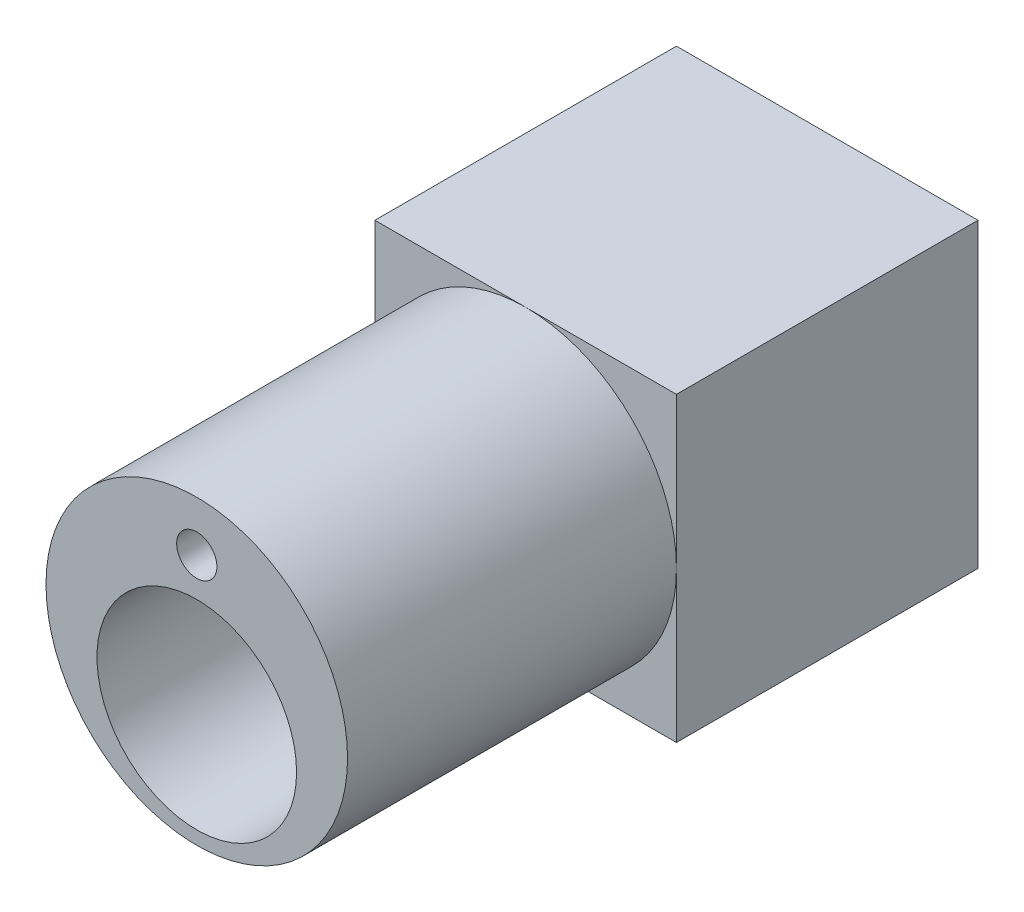
ISO-10303-21;
HEADER;
FILE_DESCRIPTION(('STEP AP214'),'2;1');
FILE_NAME('part.step','',(''),(''),'','','');
FILE_SCHEMA(('AUTOMOTIVE_DESIGN { 1 0 10303 214 1 1 1 1 }'));
ENDSEC;
DATA;
#1=APPLICATION_CONTEXT('core data for automotive mechanical design processes');
#2=APPLICATION_PROTOCOL_DEFINITION('international standard','automotive_design',2000,#1);
#3=PRODUCT_CONTEXT('',#1,'mechanical');
#4=PRODUCT('Part','Part','',(#3));
#5=PRODUCT_RELATED_PRODUCT_CATEGORY('part','',(#4));
#6=PRODUCT_DEFINITION_FORMATION('','',#4);
#7=PRODUCT_DEFINITION_CONTEXT('part definition',#1,'design');
#8=PRODUCT_DEFINITION('design','',#6,#7);
#9=PRODUCT_DEFINITION_SHAPE('','',#8);
#10=(LENGTH_UNIT() NAMED_UNIT(*) SI_UNIT(.MILLI.,.METRE.));
#11=(NAMED_UNIT(*) PLANE_ANGLE_UNIT() SI_UNIT($,.RADIAN.));
#12=(NAMED_UNIT(*) SI_UNIT($,.STERADIAN.) SOLID_ANGLE_UNIT());
#13=UNCERTAINTY_MEASURE_WITH_UNIT(LENGTH_MEASURE(1.E-05),#10,'distance_accuracy_value','');
#14=(GEOMETRIC_REPRESENTATION_CONTEXT(3) GLOBAL_UNCERTAINTY_ASSIGNED_CONTEXT((#13)) GLOBAL_UNIT_ASSIGNED_CONTEXT((#10,
#11,#12)) REPRESENTATION_CONTEXT('',''));
#15=CARTESIAN_POINT('',(0.,0.,0.));
#16=DIRECTION('',(0.,0.,1.));
#17=DIRECTION('',(1.,0.,0.));
#18=AXIS2_PLACEMENT_3D('',#15,#16,#17);
#19=CARTESIAN_POINT('',(0.,0.,61.3));
#20=DIRECTION('',(0.,0.,-1.));
#21=DIRECTION('',(-1.,0.,0.));
#22=AXIS2_PLACEMENT_3D('',#19,#20,#21);
#23=CYLINDRICAL_SURFACE('',#22,28.1);
#24=CARTESIAN_POINT('',(0.,0.,0.));
#25=DIRECTION('',(0.,0.,1.));
#26=DIRECTION('',(1.,0.,0.));
#27=AXIS2_PLACEMENT_3D('',#24,#25,#26);
#28=CIRCLE('',#27,28.1);
#29=CARTESIAN_POINT('',(-28.1,0.,0.));
#30=VERTEX_POINT('',#29);
#31=CARTESIAN_POINT('',(0.,-28.1,0.));
#32=VERTEX_POINT('',#31);
#33=EDGE_CURVE('E353',#30,#32,#28,.T.);
#34=ORIENTED_EDGE('',*,*,#33,.T.);
#35=CARTESIAN_POINT('',(28.1,0.,0.));
#36=VERTEX_POINT('',#35);
#37=EDGE_CURVE('E269',#32,#36,#28,.T.);
#38=ORIENTED_EDGE('',*,*,#37,.T.);
#39=CARTESIAN_POINT('',(0.,28.1,0.));
#40=VERTEX_POINT('',#39);
#41=EDGE_CURVE('E276',#36,#40,#28,.T.);
#42=ORIENTED_EDGE('',*,*,#41,.T.);
#43=EDGE_CURVE('E279',#40,#30,#28,.T.);
#44=ORIENTED_EDGE('',*,*,#43,.T.);
#45=EDGE_LOOP('',(#34,#38,#42,#44));
#46=FACE_BOUND('',#45,.T.);
#47=CARTESIAN_POINT('',(0.,0.,61.3));
#48=DIRECTION('',(0.,0.,1.));
#49=DIRECTION('',(1.,0.,0.));
#50=AXIS2_PLACEMENT_3D('',#47,#48,#49);
#51=CIRCLE('',#50,28.1);
#52=CARTESIAN_POINT('',(28.1,0.,61.3));
#53=VERTEX_POINT('',#52);
#54=EDGE_CURVE('E47',#53,#53,#51,.T.);
#55=ORIENTED_EDGE('',*,*,#54,.F.);
#56=EDGE_LOOP('',(#55));
#57=FACE_BOUND('',#56,.T.);
#58=ADVANCED_FACE('F39',(#46,#57),#23,.T.);
#59=CARTESIAN_POINT('',(0.,0.,61.3));
#60=DIRECTION('',(0.,0.,1.));
#61=DIRECTION('',(1.,0.,0.));
#62=AXIS2_PLACEMENT_3D('',#59,#60,#61);
#63=PLANE('',#62);
#64=CARTESIAN_POINT('',(0.,18.75,61.3));
#65=DIRECTION('',(0.,0.,1.));
#66=DIRECTION('',(1.,0.,0.));
#67=AXIS2_PLACEMENT_3D('',#64,#65,#66);
#68=CIRCLE('',#67,3.75);
#69=CARTESIAN_POINT('',(3.75,18.75,61.3));
#70=VERTEX_POINT('',#69);
#71=EDGE_CURVE('E284',#70,#70,#68,.T.);
#72=ORIENTED_EDGE('',*,*,#71,.F.);
#73=EDGE_LOOP('',(#72));
#74=FACE_BOUND('',#73,.T.);
#75=CARTESIAN_POINT('',(0.,-7.,61.3));
#76=DIRECTION('',(0.,0.,1.));
#77=DIRECTION('',(1.,0.,0.));
#78=AXIS2_PLACEMENT_3D('',#75,#76,#77);
#79=CIRCLE('',#78,18.6);
#80=CARTESIAN_POINT('',(18.6,-7.,61.3));
#81=VERTEX_POINT('',#80);
#82=EDGE_CURVE('E264',#81,#81,#79,.T.);
#83=ORIENTED_EDGE('',*,*,#82,.F.);
#84=EDGE_LOOP('',(#83));
#85=FACE_BOUND('',#84,.T.);
#86=ORIENTED_EDGE('',*,*,#54,.T.);
#87=EDGE_LOOP('',(#86));
#88=FACE_BOUND('',#87,.T.);
#89=ADVANCED_FACE('F343',(#74,#85,#88),#63,.T.);
#90=CARTESIAN_POINT('',(0.,-7.,2.5));
#91=DIRECTION('',(0.,0.,1.));
#92=DIRECTION('',(1.,0.,0.));
#93=AXIS2_PLACEMENT_3D('',#90,#91,#92);
#94=CYLINDRICAL_SURFACE('',#93,18.6);
#95=CARTESIAN_POINT('',(0.,-7.,2.5));
#96=DIRECTION('',(0.,0.,1.));
#97=DIRECTION('',(1.,0.,0.));
#98=AXIS2_PLACEMENT_3D('',#95,#96,#97);
#99=CIRCLE('',#98,18.6);
#100=CARTESIAN_POINT('',(18.6,-7.,2.5));
#101=VERTEX_POINT('',#100);
#102=EDGE_CURVE('E265',#101,#101,#99,.T.);
#103=ORIENTED_EDGE('',*,*,#102,.F.);
#104=EDGE_LOOP('',(#103));
#105=FACE_BOUND('',#104,.T.);
#106=ORIENTED_EDGE('',*,*,#82,.T.);
#107=EDGE_LOOP('',(#106));
#108=FACE_BOUND('',#107,.T.);
#109=ADVANCED_FACE('F348',(#105,#108),#94,.F.);
#110=CARTESIAN_POINT('',(0.,-7.,2.5));
#111=DIRECTION('',(0.,0.,1.));
#112=DIRECTION('',(1.,0.,0.));
#113=AXIS2_PLACEMENT_3D('',#110,#111,#112);
#114=PLANE('',#113);
#115=CARTESIAN_POINT('',(0.,-7.,2.5));
#116=DIRECTION('',(0.,0.,1.));
#117=DIRECTION('',(1.,0.,0.));
#118=AXIS2_PLACEMENT_3D('',#115,#116,#117);
#119=CIRCLE('',#118,16.1);
#120=CARTESIAN_POINT('',(16.1,-7.,2.5));
#121=VERTEX_POINT('',#120);
#122=EDGE_CURVE('E214',#121,#121,#119,.T.);
#123=ORIENTED_EDGE('',*,*,#122,.F.);
#124=EDGE_LOOP('',(#123));
#125=FACE_BOUND('',#124,.T.);
#126=ORIENTED_EDGE('',*,*,#102,.T.);
#127=EDGE_LOOP('',(#126));
#128=FACE_BOUND('',#127,.T.);
#129=ADVANCED_FACE('F398',(#125,#128),#114,.T.);
#130=CARTESIAN_POINT('',(0.,0.,0.));
#131=DIRECTION('',(0.,0.,1.));
#132=DIRECTION('',(1.,0.,0.));
#133=AXIS2_PLACEMENT_3D('',#130,#131,#132);
#134=PLANE('',#133);
#135=ORIENTED_EDGE('',*,*,#41,.F.);
#136=DIRECTION('',(0.,-1.,0.));
#137=VECTOR('',#136,1.);
#138=CARTESIAN_POINT('',(28.1,-28.1,0.));
#139=LINE('',#138,#137);
#140=CARTESIAN_POINT('',(28.1,28.1,0.));
#141=VERTEX_POINT('',#140);
#142=EDGE_CURVE('E244',#141,#36,#139,.T.);
#143=ORIENTED_EDGE('',*,*,#142,.F.);
#144=DIRECTION('',(1.,0.,0.));
#145=VECTOR('',#144,1.);
#146=CARTESIAN_POINT('',(28.1,28.1,0.));
#147=LINE('',#146,#145);
#148=EDGE_CURVE('E238',#40,#141,#147,.T.);
#149=ORIENTED_EDGE('',*,*,#148,.F.);
#150=EDGE_LOOP('',(#135,#143,#149));
#151=FACE_BOUND('',#150,.T.);
#152=ADVANCED_FACE('F396',(#151),#134,.T.);
#153=ORIENTED_EDGE('',*,*,#43,.F.);
#154=CARTESIAN_POINT('',(-28.1,28.1,0.));
#155=VERTEX_POINT('',#154);
#156=EDGE_CURVE('E239',#155,#40,#147,.T.);
#157=ORIENTED_EDGE('',*,*,#156,.F.);
#158=DIRECTION('',(0.,1.,0.));
#159=VECTOR('',#158,1.);
#160=CARTESIAN_POINT('',(-28.1,-28.1,0.));
#161=LINE('',#160,#159);
#162=EDGE_CURVE('E218',#30,#155,#161,.T.);
#163=ORIENTED_EDGE('',*,*,#162,.F.);
#164=EDGE_LOOP('',(#153,#157,#163));
#165=FACE_BOUND('',#164,.T.);
#166=ADVANCED_FACE('F386',(#165),#134,.T.);
#167=ORIENTED_EDGE('',*,*,#33,.F.);
#168=CARTESIAN_POINT('',(-28.1,-28.1,0.));
#169=VERTEX_POINT('',#168);
#170=EDGE_CURVE('E234',#169,#30,#161,.T.);
#171=ORIENTED_EDGE('',*,*,#170,.F.);
#172=DIRECTION('',(-1.,0.,0.));
#173=VECTOR('',#172,1.);
#174=CARTESIAN_POINT('',(28.1,-28.1,0.));
#175=LINE('',#174,#173);
#176=EDGE_CURVE('E247',#32,#169,#175,.T.);
#177=ORIENTED_EDGE('',*,*,#176,.F.);
#178=EDGE_LOOP('',(#167,#171,#177));
#179=FACE_BOUND('',#178,.T.);
#180=ADVANCED_FACE('F371',(#179),#134,.T.);
#181=ORIENTED_EDGE('',*,*,#37,.F.);
#182=CARTESIAN_POINT('',(28.1,-28.1,0.));
#183=VERTEX_POINT('',#182);
#184=EDGE_CURVE('E224',#183,#32,#175,.T.);
#185=ORIENTED_EDGE('',*,*,#184,.F.);
#186=EDGE_CURVE('E243',#36,#183,#139,.T.);
#187=ORIENTED_EDGE('',*,*,#186,.F.);
#188=EDGE_LOOP('',(#181,#185,#187));
#189=FACE_BOUND('',#188,.T.);
#190=ADVANCED_FACE('F373',(#189),#134,.T.);
#191=CARTESIAN_POINT('',(-28.1,-28.1,-56.2));
#192=DIRECTION('',(1.,0.,0.));
#193=DIRECTION('',(0.,0.,-1.));
#194=AXIS2_PLACEMENT_3D('',#191,#192,#193);
#195=PLANE('',#194);
#196=ORIENTED_EDGE('',*,*,#170,.T.);
#197=ORIENTED_EDGE('',*,*,#162,.T.);
#198=DIRECTION('',(0.,0.,1.));
#199=VECTOR('',#198,1.);
#200=CARTESIAN_POINT('',(-28.1,28.1,-56.2));
#201=LINE('',#200,#199);
#202=CARTESIAN_POINT('',(-28.1,28.1,-56.2));
#203=VERTEX_POINT('',#202);
#204=EDGE_CURVE('E260',#203,#155,#201,.T.);
#205=ORIENTED_EDGE('',*,*,#204,.F.);
#206=DIRECTION('',(0.,1.,0.));
#207=VECTOR('',#206,1.);
#208=CARTESIAN_POINT('',(-28.1,-28.1,-56.2));
#209=LINE('',#208,#207);
#210=CARTESIAN_POINT('',(-28.1,-28.1,-56.2));
#211=VERTEX_POINT('',#210);
#212=EDGE_CURVE('E219',#211,#203,#209,.T.);
#213=ORIENTED_EDGE('',*,*,#212,.F.);
#214=DIRECTION('',(0.,0.,1.));
#215=VECTOR('',#214,1.);
#216=CARTESIAN_POINT('',(-28.1,-28.1,-56.2));
#217=LINE('',#216,#215);
#218=EDGE_CURVE('E233',#211,#169,#217,.T.);
#219=ORIENTED_EDGE('',*,*,#218,.T.);
#220=EDGE_LOOP('',(#196,#197,#205,#213,#219));
#221=FACE_BOUND('',#220,.T.);
#222=ADVANCED_FACE('F383',(#221),#195,.F.);
#223=CARTESIAN_POINT('',(28.1,28.1,-56.2));
#224=DIRECTION('',(0.,-1.,0.));
#225=DIRECTION('',(0.,0.,-1.));
#226=AXIS2_PLACEMENT_3D('',#223,#224,#225);
#227=PLANE('',#226);
#228=ORIENTED_EDGE('',*,*,#156,.T.);
#229=ORIENTED_EDGE('',*,*,#148,.T.);
#230=DIRECTION('',(0.,0.,1.));
#231=VECTOR('',#230,1.);
#232=CARTESIAN_POINT('',(28.1,28.1,-56.2));
#233=LINE('',#232,#231);
#234=CARTESIAN_POINT('',(28.1,28.1,-56.2));
#235=VERTEX_POINT('',#234);
#236=EDGE_CURVE('E256',#235,#141,#233,.T.);
#237=ORIENTED_EDGE('',*,*,#236,.F.);
#238=DIRECTION('',(1.,0.,0.));
#239=VECTOR('',#238,1.);
#240=CARTESIAN_POINT('',(28.1,28.1,-56.2));
#241=LINE('',#240,#239);
#242=EDGE_CURVE('E223',#203,#235,#241,.T.);
#243=ORIENTED_EDGE('',*,*,#242,.F.);
#244=ORIENTED_EDGE('',*,*,#204,.T.);
#245=EDGE_LOOP('',(#228,#229,#237,#243,#244));
#246=FACE_BOUND('',#245,.T.);
#247=ADVANCED_FACE('F389',(#246),#227,.F.);
#248=CARTESIAN_POINT('',(28.1,-28.1,-56.2));
#249=DIRECTION('',(-1.,0.,0.));
#250=DIRECTION('',(0.,0.,1.));
#251=AXIS2_PLACEMENT_3D('',#248,#249,#250);
#252=PLANE('',#251);
#253=ORIENTED_EDGE('',*,*,#142,.T.);
#254=ORIENTED_EDGE('',*,*,#186,.T.);
#255=DIRECTION('',(0.,0.,1.));
#256=VECTOR('',#255,1.);
#257=CARTESIAN_POINT('',(28.1,-28.1,-56.2));
#258=LINE('',#257,#256);
#259=CARTESIAN_POINT('',(28.1,-28.1,-56.2));
#260=VERTEX_POINT('',#259);
#261=EDGE_CURVE('E253',#260,#183,#258,.T.);
#262=ORIENTED_EDGE('',*,*,#261,.F.);
#263=DIRECTION('',(0.,-1.,0.));
#264=VECTOR('',#263,1.);
#265=CARTESIAN_POINT('',(28.1,-28.1,-56.2));
#266=LINE('',#265,#264);
#267=EDGE_CURVE('E227',#235,#260,#266,.T.);
#268=ORIENTED_EDGE('',*,*,#267,.F.);
#269=ORIENTED_EDGE('',*,*,#236,.T.);
#270=EDGE_LOOP('',(#253,#254,#262,#268,#269));
#271=FACE_BOUND('',#270,.T.);
#272=ADVANCED_FACE('F393',(#271),#252,.F.);
#273=CARTESIAN_POINT('',(28.1,-28.1,-56.2));
#274=DIRECTION('',(0.,1.,0.));
#275=DIRECTION('',(0.,0.,1.));
#276=AXIS2_PLACEMENT_3D('',#273,#274,#275);
#277=PLANE('',#276);
#278=ORIENTED_EDGE('',*,*,#184,.T.);
#279=ORIENTED_EDGE('',*,*,#176,.T.);
#280=ORIENTED_EDGE('',*,*,#218,.F.);
#281=DIRECTION('',(-1.,0.,0.));
#282=VECTOR('',#281,1.);
#283=CARTESIAN_POINT('',(28.1,-28.1,-56.2));
#284=LINE('',#283,#282);
#285=EDGE_CURVE('E230',#260,#211,#284,.T.);
#286=ORIENTED_EDGE('',*,*,#285,.F.);
#287=ORIENTED_EDGE('',*,*,#261,.T.);
#288=EDGE_LOOP('',(#278,#279,#280,#286,#287));
#289=FACE_BOUND('',#288,.T.);
#290=CARTESIAN_POINT('',(0.,-28.1,-28.3320788958154));
#291=DIRECTION('',(0.,1.,0.));
#292=DIRECTION('',(0.,0.,1.));
#293=AXIS2_PLACEMENT_3D('',#290,#291,#292);
#294=CIRCLE('',#293,15.);
#295=CARTESIAN_POINT('',(-15.,-28.1,-28.3320788958154));
#296=VERTEX_POINT('',#295);
#297=CARTESIAN_POINT('',(15.,-28.1000000000001,-28.3320788958154));
#298=VERTEX_POINT('',#297);
#299=EDGE_CURVE('E54',#296,#298,#294,.F.);
#300=ORIENTED_EDGE('',*,*,#299,.T.);
#301=CARTESIAN_POINT('',(18.75,-28.1,-28.3320788958154));
#302=DIRECTION('',(0.,1.,0.));
#303=DIRECTION('',(0.,0.,1.));
#304=AXIS2_PLACEMENT_3D('',#301,#302,#303);
#305=CIRCLE('',#304,3.75);
#306=CARTESIAN_POINT('',(22.5,-28.1,-28.3320788958154));
#307=VERTEX_POINT('',#306);
#308=EDGE_CURVE('E11',#307,#298,#305,.F.);
#309=ORIENTED_EDGE('',*,*,#308,.F.);
#310=CARTESIAN_POINT('',(0.,-28.1,-28.3320788958154));
#311=DIRECTION('',(0.,1.,0.));
#312=DIRECTION('',(0.,0.,1.));
#313=AXIS2_PLACEMENT_3D('',#310,#311,#312);
#314=CIRCLE('',#313,22.5);
#315=CARTESIAN_POINT('',(-22.5,-28.1,-28.3320788958154));
#316=VERTEX_POINT('',#315);
#317=EDGE_CURVE('E139',#307,#316,#314,.T.);
#318=ORIENTED_EDGE('',*,*,#317,.T.);
#319=CARTESIAN_POINT('',(-18.75,-28.1,-28.3320788958154));
#320=DIRECTION('',(0.,1.,0.));
#321=DIRECTION('',(0.,0.,1.));
#322=AXIS2_PLACEMENT_3D('',#319,#320,#321);
#323=CIRCLE('',#322,3.75);
#324=EDGE_CURVE('E301',#296,#316,#323,.F.);
#325=ORIENTED_EDGE('',*,*,#324,.F.);
#326=EDGE_LOOP('',(#300,#309,#318,#325));
#327=FACE_BOUND('',#326,.T.);
#328=ADVANCED_FACE('F138',(#289,#327),#277,.F.);
#329=CARTESIAN_POINT('',(0.,0.,-56.2));
#330=DIRECTION('',(0.,0.,1.));
#331=DIRECTION('',(1.,0.,0.));
#332=AXIS2_PLACEMENT_3D('',#329,#330,#331);
#333=PLANE('',#332);
#334=DIRECTION('',(1.,0.,0.));
#335=VECTOR('',#334,1.);
#336=CARTESIAN_POINT('',(24.8986957114994,24.8896277262816,-56.2));
#337=LINE('',#336,#335);
#338=CARTESIAN_POINT('',(-24.8986957114994,24.8896277262816,-56.2));
#339=VERTEX_POINT('',#338);
#340=CARTESIAN_POINT('',(24.8986957114994,24.8896277262816,-56.2));
#341=VERTEX_POINT('',#340);
#342=EDGE_CURVE('E187',#339,#341,#337,.T.);
#343=ORIENTED_EDGE('',*,*,#342,.F.);
#344=DIRECTION('',(0.,1.,0.));
#345=VECTOR('',#344,1.);
#346=CARTESIAN_POINT('',(-24.8986957114994,-24.8896277262816,-56.2));
#347=LINE('',#346,#345);
#348=CARTESIAN_POINT('',(-24.8986957114994,-24.8896277262816,-56.2));
#349=VERTEX_POINT('',#348);
#350=EDGE_CURVE('E166',#349,#339,#347,.T.);
#351=ORIENTED_EDGE('',*,*,#350,.F.);
#352=DIRECTION('',(-1.,0.,0.));
#353=VECTOR('',#352,1.);
#354=CARTESIAN_POINT('',(24.8986957114994,-24.8896277262816,-56.2));
#355=LINE('',#354,#353);
#356=CARTESIAN_POINT('',(24.8986957114994,-24.8896277262816,-56.2));
#357=VERTEX_POINT('',#356);
#358=EDGE_CURVE('E172',#357,#349,#355,.T.);
#359=ORIENTED_EDGE('',*,*,#358,.F.);
#360=DIRECTION('',(0.,-1.,0.));
#361=VECTOR('',#360,1.);
#362=CARTESIAN_POINT('',(24.8986957114994,-24.8896277262816,-56.2));
#363=LINE('',#362,#361);
#364=EDGE_CURVE('E191',#341,#357,#363,.T.);
#365=ORIENTED_EDGE('',*,*,#364,.F.);
#366=EDGE_LOOP('',(#343,#351,#359,#365));
#367=FACE_BOUND('',#366,.T.);
#368=ORIENTED_EDGE('',*,*,#212,.T.);
#369=ORIENTED_EDGE('',*,*,#242,.T.);
#370=ORIENTED_EDGE('',*,*,#267,.T.);
#371=ORIENTED_EDGE('',*,*,#285,.T.);
#372=EDGE_LOOP('',(#368,#369,#370,#371));
#373=FACE_BOUND('',#372,.T.);
#374=ADVANCED_FACE('F326',(#367,#373),#333,.F.);
#375=CARTESIAN_POINT('',(0.,-7.,-2.5));
#376=DIRECTION('',(0.,0.,1.));
#377=DIRECTION('',(1.,0.,0.));
#378=AXIS2_PLACEMENT_3D('',#375,#376,#377);
#379=CYLINDRICAL_SURFACE('',#378,16.1);
#380=CARTESIAN_POINT('',(0.,-7.,-2.5));
#381=DIRECTION('',(0.,0.,1.));
#382=DIRECTION('',(1.,0.,0.));
#383=AXIS2_PLACEMENT_3D('',#380,#381,#382);
#384=CIRCLE('',#383,16.1);
#385=CARTESIAN_POINT('',(16.1,-7.,-2.5));
#386=VERTEX_POINT('',#385);
#387=EDGE_CURVE('E201',#386,#386,#384,.T.);
#388=ORIENTED_EDGE('',*,*,#387,.F.);
#389=EDGE_LOOP('',(#388));
#390=FACE_BOUND('',#389,.T.);
#391=ORIENTED_EDGE('',*,*,#122,.T.);
#392=EDGE_LOOP('',(#391));
#393=FACE_BOUND('',#392,.T.);
#394=ADVANCED_FACE('F448',(#390,#393),#379,.F.);
#395=CARTESIAN_POINT('',(-24.8986957114994,-24.8896277262816,-2.5));
#396=DIRECTION('',(-1.,0.,0.));
#397=DIRECTION('',(0.,0.,1.));
#398=AXIS2_PLACEMENT_3D('',#395,#396,#397);
#399=PLANE('',#398);
#400=ORIENTED_EDGE('',*,*,#350,.T.);
#401=DIRECTION('',(0.,0.,-1.));
#402=VECTOR('',#401,1.);
#403=CARTESIAN_POINT('',(-24.8986957114994,24.8896277262816,-2.5));
#404=LINE('',#403,#402);
#405=CARTESIAN_POINT('',(-24.8986957114994,24.8896277262816,-2.5));
#406=VERTEX_POINT('',#405);
#407=EDGE_CURVE('E184',#406,#339,#404,.T.);
#408=ORIENTED_EDGE('',*,*,#407,.F.);
#409=DIRECTION('',(0.,1.,0.));
#410=VECTOR('',#409,1.);
#411=CARTESIAN_POINT('',(-24.8986957114994,-24.8896277262816,-2.5));
#412=LINE('',#411,#410);
#413=CARTESIAN_POINT('',(-24.8986957114994,-24.8896277262816,-2.5));
#414=VERTEX_POINT('',#413);
#415=EDGE_CURVE('E167',#414,#406,#412,.T.);
#416=ORIENTED_EDGE('',*,*,#415,.F.);
#417=DIRECTION('',(0.,0.,-1.));
#418=VECTOR('',#417,1.);
#419=CARTESIAN_POINT('',(-24.8986957114994,-24.8896277262816,-2.5));
#420=LINE('',#419,#418);
#421=EDGE_CURVE('E198',#414,#349,#420,.T.);
#422=ORIENTED_EDGE('',*,*,#421,.T.);
#423=EDGE_LOOP('',(#400,#408,#416,#422));
#424=FACE_BOUND('',#423,.T.);
#425=ADVANCED_FACE('F317',(#424),#399,.F.);
#426=CARTESIAN_POINT('',(24.8986957114994,-24.8896277262816,-2.5));
#427=DIRECTION('',(0.,-1.,0.));
#428=DIRECTION('',(0.,0.,-1.));
#429=AXIS2_PLACEMENT_3D('',#426,#427,#428);
#430=PLANE('',#429);
#431=CARTESIAN_POINT('',(0.,-24.8896277262816,-28.3320788958154));
#432=DIRECTION('',(0.,-1.,0.));
#433=DIRECTION('',(0.,0.,-1.));
#434=AXIS2_PLACEMENT_3D('',#431,#432,#433);
#435=CIRCLE('',#434,22.5);
#436=CARTESIAN_POINT('',(22.5,-24.8896277262816,-28.3320788958154));
#437=VERTEX_POINT('',#436);
#438=CARTESIAN_POINT('',(-22.5,-24.8896277262816,-28.3320788958154));
#439=VERTEX_POINT('',#438);
#440=EDGE_CURVE('E153',#437,#439,#435,.F.);
#441=ORIENTED_EDGE('',*,*,#440,.F.);
#442=CARTESIAN_POINT('',(18.75,-24.8896277262816,-28.3320788958154));
#443=DIRECTION('',(0.,-1.,0.));
#444=DIRECTION('',(0.,0.,-1.));
#445=AXIS2_PLACEMENT_3D('',#442,#443,#444);
#446=CIRCLE('',#445,3.75);
#447=CARTESIAN_POINT('',(15.,-24.8896277262816,-28.3320788958154));
#448=VERTEX_POINT('',#447);
#449=EDGE_CURVE('E61',#437,#448,#446,.T.);
#450=ORIENTED_EDGE('',*,*,#449,.T.);
#451=CARTESIAN_POINT('',(0.,-24.8896277262816,-28.3320788958154));
#452=DIRECTION('',(0.,-1.,0.));
#453=DIRECTION('',(0.,0.,-1.));
#454=AXIS2_PLACEMENT_3D('',#451,#452,#453);
#455=CIRCLE('',#454,15.);
#456=CARTESIAN_POINT('',(-15.,-24.8896277262816,-28.3320788958154));
#457=VERTEX_POINT('',#456);
#458=EDGE_CURVE('E158',#457,#448,#455,.T.);
#459=ORIENTED_EDGE('',*,*,#458,.F.);
#460=CARTESIAN_POINT('',(-18.75,-24.8896277262816,-28.3320788958154));
#461=DIRECTION('',(0.,-1.,0.));
#462=DIRECTION('',(0.,0.,-1.));
#463=AXIS2_PLACEMENT_3D('',#460,#461,#462);
#464=CIRCLE('',#463,3.75);
#465=EDGE_CURVE('E295',#457,#439,#464,.T.);
#466=ORIENTED_EDGE('',*,*,#465,.T.);
#467=EDGE_LOOP('',(#441,#450,#459,#466));
#468=FACE_BOUND('',#467,.T.);
#469=ORIENTED_EDGE('',*,*,#358,.T.);
#470=ORIENTED_EDGE('',*,*,#421,.F.);
#471=DIRECTION('',(-1.,0.,0.));
#472=VECTOR('',#471,1.);
#473=CARTESIAN_POINT('',(24.8986957114994,-24.8896277262816,-2.5));
#474=LINE('',#473,#472);
#475=CARTESIAN_POINT('',(24.8986957114994,-24.8896277262816,-2.5));
#476=VERTEX_POINT('',#475);
#477=EDGE_CURVE('E180',#476,#414,#474,.T.);
#478=ORIENTED_EDGE('',*,*,#477,.F.);
#479=DIRECTION('',(0.,0.,-1.));
#480=VECTOR('',#479,1.);
#481=CARTESIAN_POINT('',(24.8986957114994,-24.8896277262816,-2.5));
#482=LINE('',#481,#480);
#483=EDGE_CURVE('E202',#476,#357,#482,.T.);
#484=ORIENTED_EDGE('',*,*,#483,.T.);
#485=EDGE_LOOP('',(#469,#470,#478,#484));
#486=FACE_BOUND('',#485,.T.);
#487=ADVANCED_FACE('F313',(#468,#486),#430,.F.);
#488=CARTESIAN_POINT('',(24.8986957114994,-24.8896277262816,-2.5));
#489=DIRECTION('',(1.,0.,0.));
#490=DIRECTION('',(0.,0.,-1.));
#491=AXIS2_PLACEMENT_3D('',#488,#489,#490);
#492=PLANE('',#491);
#493=ORIENTED_EDGE('',*,*,#364,.T.);
#494=ORIENTED_EDGE('',*,*,#483,.F.);
#495=DIRECTION('',(0.,-1.,0.));
#496=VECTOR('',#495,1.);
#497=CARTESIAN_POINT('',(24.8986957114994,-24.8896277262816,-2.5));
#498=LINE('',#497,#496);
#499=CARTESIAN_POINT('',(24.8986957114994,24.8896277262816,-2.5));
#500=VERTEX_POINT('',#499);
#501=EDGE_CURVE('E176',#500,#476,#498,.T.);
#502=ORIENTED_EDGE('',*,*,#501,.F.);
#503=DIRECTION('',(0.,0.,-1.));
#504=VECTOR('',#503,1.);
#505=CARTESIAN_POINT('',(24.8986957114994,24.8896277262816,-2.5));
#506=LINE('',#505,#504);
#507=EDGE_CURVE('E205',#500,#341,#506,.T.);
#508=ORIENTED_EDGE('',*,*,#507,.T.);
#509=EDGE_LOOP('',(#493,#494,#502,#508));
#510=FACE_BOUND('',#509,.T.);
#511=ADVANCED_FACE('F316',(#510),#492,.F.);
#512=CARTESIAN_POINT('',(24.8986957114994,24.8896277262816,-2.5));
#513=DIRECTION('',(0.,1.,0.));
#514=DIRECTION('',(0.,0.,1.));
#515=AXIS2_PLACEMENT_3D('',#512,#513,#514);
#516=PLANE('',#515);
#517=ORIENTED_EDGE('',*,*,#342,.T.);
#518=ORIENTED_EDGE('',*,*,#507,.F.);
#519=DIRECTION('',(1.,0.,0.));
#520=VECTOR('',#519,1.);
#521=CARTESIAN_POINT('',(24.8986957114994,24.8896277262816,-2.5));
#522=LINE('',#521,#520);
#523=EDGE_CURVE('E171',#406,#500,#522,.T.);
#524=ORIENTED_EDGE('',*,*,#523,.F.);
#525=ORIENTED_EDGE('',*,*,#407,.T.);
#526=EDGE_LOOP('',(#517,#518,#524,#525));
#527=FACE_BOUND('',#526,.T.);
#528=ADVANCED_FACE('F331',(#527),#516,.F.);
#529=CARTESIAN_POINT('',(0.,0.,-2.5));
#530=DIRECTION('',(0.,0.,1.));
#531=DIRECTION('',(1.,0.,0.));
#532=AXIS2_PLACEMENT_3D('',#529,#530,#531);
#533=PLANE('',#532);
#534=CARTESIAN_POINT('',(0.,18.75,-2.5));
#535=DIRECTION('',(0.,0.,1.));
#536=DIRECTION('',(1.,0.,0.));
#537=AXIS2_PLACEMENT_3D('',#534,#535,#536);
#538=CIRCLE('',#537,3.75);
#539=CARTESIAN_POINT('',(3.75,18.75,-2.5));
#540=VERTEX_POINT('',#539);
#541=EDGE_CURVE('E280',#540,#540,#538,.T.);
#542=ORIENTED_EDGE('',*,*,#541,.T.);
#543=EDGE_LOOP('',(#542));
#544=FACE_BOUND('',#543,.T.);
#545=ORIENTED_EDGE('',*,*,#387,.T.);
#546=EDGE_LOOP('',(#545));
#547=FACE_BOUND('',#546,.T.);
#548=ORIENTED_EDGE('',*,*,#415,.T.);
#549=ORIENTED_EDGE('',*,*,#523,.T.);
#550=ORIENTED_EDGE('',*,*,#501,.T.);
#551=ORIENTED_EDGE('',*,*,#477,.T.);
#552=EDGE_LOOP('',(#548,#549,#550,#551));
#553=FACE_BOUND('',#552,.T.);
#554=ADVANCED_FACE('F334',(#544,#547,#553),#533,.F.);
#555=CARTESIAN_POINT('',(0.,-349.6,-28.3320788958154));
#556=DIRECTION('',(0.,-1.,0.));
#557=DIRECTION('',(0.,0.,-1.));
#558=AXIS2_PLACEMENT_3D('',#555,#556,#557);
#559=CYLINDRICAL_SURFACE('',#558,15.);
#560=ORIENTED_EDGE('',*,*,#299,.F.);
#561=DIRECTION('',(0.,1.,0.));
#562=VECTOR('',#561,1.);
#563=CARTESIAN_POINT('',(-15.,-349.6,-28.3320788958154));
#564=LINE('',#563,#562);
#565=EDGE_CURVE('E283',#296,#457,#564,.T.);
#566=ORIENTED_EDGE('',*,*,#565,.T.);
#567=ORIENTED_EDGE('',*,*,#458,.T.);
#568=DIRECTION('',(0.,1.,0.));
#569=VECTOR('',#568,1.);
#570=CARTESIAN_POINT('',(15.,-349.6,-28.3320788958154));
#571=LINE('',#570,#569);
#572=EDGE_CURVE('E154',#298,#448,#571,.T.);
#573=ORIENTED_EDGE('',*,*,#572,.F.);
#574=EDGE_LOOP('',(#560,#566,#567,#573));
#575=FACE_BOUND('',#574,.T.);
#576=ADVANCED_FACE('F310',(#575),#559,.T.);
#577=CARTESIAN_POINT('',(0.,-349.6,-28.3320788958154));
#578=DIRECTION('',(0.,-1.,0.));
#579=DIRECTION('',(0.,0.,-1.));
#580=AXIS2_PLACEMENT_3D('',#577,#578,#579);
#581=CYLINDRICAL_SURFACE('',#580,22.5);
#582=ORIENTED_EDGE('',*,*,#317,.F.);
#583=DIRECTION('',(0.,-1.,0.));
#584=VECTOR('',#583,1.);
#585=CARTESIAN_POINT('',(22.5,-349.6,-28.3320788958154));
#586=LINE('',#585,#584);
#587=EDGE_CURVE('E146',#437,#307,#586,.T.);
#588=ORIENTED_EDGE('',*,*,#587,.F.);
#589=ORIENTED_EDGE('',*,*,#440,.T.);
#590=DIRECTION('',(0.,-1.,0.));
#591=VECTOR('',#590,1.);
#592=CARTESIAN_POINT('',(-22.5,-349.6,-28.3320788958154));
#593=LINE('',#592,#591);
#594=EDGE_CURVE('E148',#439,#316,#593,.T.);
#595=ORIENTED_EDGE('',*,*,#594,.T.);
#596=EDGE_LOOP('',(#582,#588,#589,#595));
#597=FACE_BOUND('',#596,.T.);
#598=ADVANCED_FACE('F144',(#597),#581,.F.);
#599=CARTESIAN_POINT('',(0.,18.75,-38.7));
#600=DIRECTION('',(0.,0.,1.));
#601=DIRECTION('',(1.,0.,0.));
#602=AXIS2_PLACEMENT_3D('',#599,#600,#601);
#603=CYLINDRICAL_SURFACE('',#602,3.75);
#604=ORIENTED_EDGE('',*,*,#71,.T.);
#605=EDGE_LOOP('',(#604));
#606=FACE_BOUND('',#605,.T.);
#607=ORIENTED_EDGE('',*,*,#541,.F.);
#608=EDGE_LOOP('',(#607));
#609=FACE_BOUND('',#608,.T.);
#610=ADVANCED_FACE('F489',(#606,#609),#603,.F.);
#611=CARTESIAN_POINT('',(-18.75,-24.6,-28.3320788958154));
#612=DIRECTION('',(0.,-1.,0.));
#613=DIRECTION('',(0.,0.,-1.));
#614=AXIS2_PLACEMENT_3D('',#611,#612,#613);
#615=CYLINDRICAL_SURFACE('',#614,3.75);
#616=ORIENTED_EDGE('',*,*,#565,.F.);
#617=ORIENTED_EDGE('',*,*,#324,.T.);
#618=ORIENTED_EDGE('',*,*,#594,.F.);
#619=ORIENTED_EDGE('',*,*,#465,.F.);
#620=EDGE_LOOP('',(#616,#617,#618,#619));
#621=FACE_BOUND('',#620,.T.);
#622=ADVANCED_FACE('F307',(#621),#615,.F.);
#623=CARTESIAN_POINT('',(18.75,-24.6,-28.3320788958154));
#624=DIRECTION('',(0.,-1.,0.));
#625=DIRECTION('',(0.,0.,-1.));
#626=AXIS2_PLACEMENT_3D('',#623,#624,#625);
#627=CYLINDRICAL_SURFACE('',#626,3.75);
#628=ORIENTED_EDGE('',*,*,#587,.T.);
#629=ORIENTED_EDGE('',*,*,#308,.T.);
#630=ORIENTED_EDGE('',*,*,#572,.T.);
#631=ORIENTED_EDGE('',*,*,#449,.F.);
#632=EDGE_LOOP('',(#628,#629,#630,#631));
#633=FACE_BOUND('',#632,.T.);
#634=ADVANCED_FACE('F151',(#633),#627,.F.);
#635=CLOSED_SHELL('',(#58,#89,#109,#129,#152,#166,#180,#190,#222,#247,#272,#328,#374,#394,#425,
#487,#511,#528,#554,#576,#598,#610,#622,#634));
#636=MANIFOLD_SOLID_BREP('B2',#635);
#637=ADVANCED_BREP_SHAPE_REPRESENTATION('',(#18,#636),#14);
#638=SHAPE_DEFINITION_REPRESENTATION(#9,#637);
ENDSEC;
END-ISO-10303-21;
